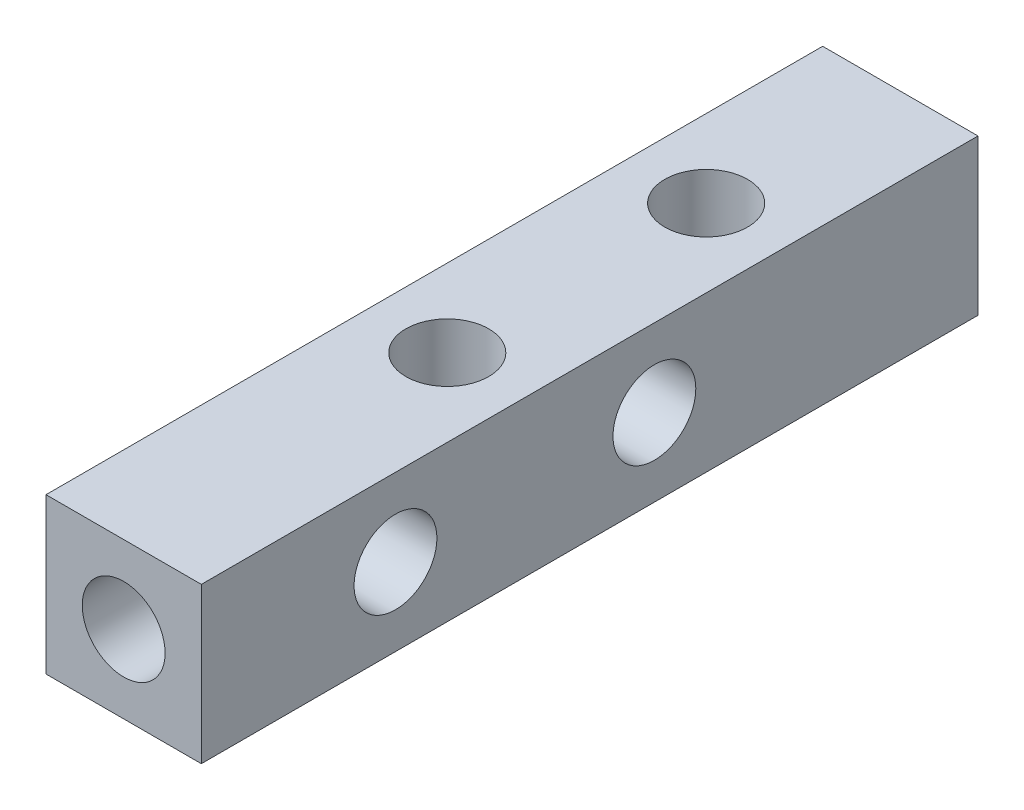
ISO-10303-21;
HEADER;
FILE_DESCRIPTION(('STEP AP214'),'2;1');
FILE_NAME('part.step','',(''),(''),'','','');
FILE_SCHEMA(('AUTOMOTIVE_DESIGN { 1 0 10303 214 1 1 1 1 }'));
ENDSEC;
DATA;
#1=APPLICATION_CONTEXT('core data for automotive mechanical design processes');
#2=APPLICATION_PROTOCOL_DEFINITION('international standard','automotive_design',2000,#1);
#3=PRODUCT_CONTEXT('',#1,'mechanical');
#4=PRODUCT('Part','Part','',(#3));
#5=PRODUCT_RELATED_PRODUCT_CATEGORY('part','',(#4));
#6=PRODUCT_DEFINITION_FORMATION('','',#4);
#7=PRODUCT_DEFINITION_CONTEXT('part definition',#1,'design');
#8=PRODUCT_DEFINITION('design','',#6,#7);
#9=PRODUCT_DEFINITION_SHAPE('','',#8);
#10=(LENGTH_UNIT() NAMED_UNIT(*) SI_UNIT(.MILLI.,.METRE.));
#11=(NAMED_UNIT(*) PLANE_ANGLE_UNIT() SI_UNIT($,.RADIAN.));
#12=(NAMED_UNIT(*) SI_UNIT($,.STERADIAN.) SOLID_ANGLE_UNIT());
#13=UNCERTAINTY_MEASURE_WITH_UNIT(LENGTH_MEASURE(1.E-05),#10,'distance_accuracy_value','');
#14=(GEOMETRIC_REPRESENTATION_CONTEXT(3) GLOBAL_UNCERTAINTY_ASSIGNED_CONTEXT((#13)) GLOBAL_UNIT_ASSIGNED_CONTEXT((#10,
#11,#12)) REPRESENTATION_CONTEXT('',''));
#15=CARTESIAN_POINT('',(0.,0.,0.));
#16=DIRECTION('',(0.,0.,1.));
#17=DIRECTION('',(1.,0.,0.));
#18=AXIS2_PLACEMENT_3D('',#15,#16,#17);
#19=CARTESIAN_POINT('',(0.,6.,30.));
#20=DIRECTION('',(1.,0.,0.));
#21=DIRECTION('',(0.,0.,-1.));
#22=AXIS2_PLACEMENT_3D('',#19,#20,#21);
#23=PLANE('',#22);
#24=CARTESIAN_POINT('',(0.,3.,22.5));
#25=DIRECTION('',(1.,0.,0.));
#26=DIRECTION('',(0.,0.,-1.));
#27=AXIS2_PLACEMENT_3D('',#24,#25,#26);
#28=CIRCLE('',#27,1.6);
#29=CARTESIAN_POINT('',(0.,3.,20.9));
#30=VERTEX_POINT('',#29);
#31=EDGE_CURVE('E122',#30,#30,#28,.T.);
#32=ORIENTED_EDGE('',*,*,#31,.T.);
#33=EDGE_LOOP('',(#32));
#34=FACE_BOUND('',#33,.T.);
#35=CARTESIAN_POINT('',(0.,2.99999999999999,12.5));
#36=DIRECTION('',(1.,0.,0.));
#37=DIRECTION('',(0.,0.,-1.));
#38=AXIS2_PLACEMENT_3D('',#35,#36,#37);
#39=CIRCLE('',#38,1.6);
#40=CARTESIAN_POINT('',(0.,2.99999999999999,10.9));
#41=VERTEX_POINT('',#40);
#42=EDGE_CURVE('E127',#41,#41,#39,.T.);
#43=ORIENTED_EDGE('',*,*,#42,.T.);
#44=EDGE_LOOP('',(#43));
#45=FACE_BOUND('',#44,.T.);
#46=DIRECTION('',(0.,-1.,0.));
#47=VECTOR('',#46,1.);
#48=CARTESIAN_POINT('',(0.,6.,0.));
#49=LINE('',#48,#47);
#50=CARTESIAN_POINT('',(0.,6.,0.));
#51=VERTEX_POINT('',#50);
#52=CARTESIAN_POINT('',(0.,0.,0.));
#53=VERTEX_POINT('',#52);
#54=EDGE_CURVE('E99',#51,#53,#49,.T.);
#55=ORIENTED_EDGE('',*,*,#54,.T.);
#56=DIRECTION('',(0.,0.,-1.));
#57=VECTOR('',#56,1.);
#58=CARTESIAN_POINT('',(0.,0.,30.));
#59=LINE('',#58,#57);
#60=CARTESIAN_POINT('',(0.,0.,30.));
#61=VERTEX_POINT('',#60);
#62=EDGE_CURVE('E11',#61,#53,#59,.T.);
#63=ORIENTED_EDGE('',*,*,#62,.F.);
#64=DIRECTION('',(0.,-1.,0.));
#65=VECTOR('',#64,1.);
#66=CARTESIAN_POINT('',(0.,6.,30.));
#67=LINE('',#66,#65);
#68=CARTESIAN_POINT('',(0.,6.,30.));
#69=VERTEX_POINT('',#68);
#70=EDGE_CURVE('E87',#69,#61,#67,.T.);
#71=ORIENTED_EDGE('',*,*,#70,.F.);
#72=DIRECTION('',(0.,0.,-1.));
#73=VECTOR('',#72,1.);
#74=CARTESIAN_POINT('',(0.,6.,30.));
#75=LINE('',#74,#73);
#76=EDGE_CURVE('E95',#69,#51,#75,.T.);
#77=ORIENTED_EDGE('',*,*,#76,.T.);
#78=EDGE_LOOP('',(#55,#63,#71,#77));
#79=FACE_BOUND('',#78,.T.);
#80=ADVANCED_FACE('F36',(#34,#45,#79),#23,.F.);
#81=CARTESIAN_POINT('',(0.,0.,30.));
#82=DIRECTION('',(0.,1.,0.));
#83=DIRECTION('',(0.,0.,1.));
#84=AXIS2_PLACEMENT_3D('',#81,#82,#83);
#85=PLANE('',#84);
#86=CARTESIAN_POINT('',(3.,0.,7.5));
#87=DIRECTION('',(0.,1.,0.));
#88=DIRECTION('',(0.,0.,1.));
#89=AXIS2_PLACEMENT_3D('',#86,#87,#88);
#90=CIRCLE('',#89,1.6);
#91=CARTESIAN_POINT('',(3.,0.,9.1));
#92=VERTEX_POINT('',#91);
#93=EDGE_CURVE('E134',#92,#92,#90,.T.);
#94=ORIENTED_EDGE('',*,*,#93,.T.);
#95=EDGE_LOOP('',(#94));
#96=FACE_BOUND('',#95,.T.);
#97=CARTESIAN_POINT('',(3.,0.,17.5));
#98=DIRECTION('',(0.,1.,0.));
#99=DIRECTION('',(0.,0.,1.));
#100=AXIS2_PLACEMENT_3D('',#97,#98,#99);
#101=CIRCLE('',#100,1.6);
#102=CARTESIAN_POINT('',(3.,0.,19.1));
#103=VERTEX_POINT('',#102);
#104=EDGE_CURVE('E139',#103,#103,#101,.T.);
#105=ORIENTED_EDGE('',*,*,#104,.T.);
#106=EDGE_LOOP('',(#105));
#107=FACE_BOUND('',#106,.T.);
#108=DIRECTION('',(1.,0.,0.));
#109=VECTOR('',#108,1.);
#110=CARTESIAN_POINT('',(0.,0.,0.));
#111=LINE('',#110,#109);
#112=CARTESIAN_POINT('',(6.,0.,0.));
#113=VERTEX_POINT('',#112);
#114=EDGE_CURVE('E91',#53,#113,#111,.T.);
#115=ORIENTED_EDGE('',*,*,#114,.T.);
#116=DIRECTION('',(0.,0.,-1.));
#117=VECTOR('',#116,1.);
#118=CARTESIAN_POINT('',(6.,0.,30.));
#119=LINE('',#118,#117);
#120=CARTESIAN_POINT('',(6.,0.,30.));
#121=VERTEX_POINT('',#120);
#122=EDGE_CURVE('E44',#121,#113,#119,.T.);
#123=ORIENTED_EDGE('',*,*,#122,.F.);
#124=DIRECTION('',(1.,0.,0.));
#125=VECTOR('',#124,1.);
#126=CARTESIAN_POINT('',(0.,0.,30.));
#127=LINE('',#126,#125);
#128=EDGE_CURVE('E82',#61,#121,#127,.T.);
#129=ORIENTED_EDGE('',*,*,#128,.F.);
#130=ORIENTED_EDGE('',*,*,#62,.T.);
#131=EDGE_LOOP('',(#115,#123,#129,#130));
#132=FACE_BOUND('',#131,.T.);
#133=ADVANCED_FACE('F90',(#96,#107,#132),#85,.F.);
#134=CARTESIAN_POINT('',(6.,0.,30.));
#135=DIRECTION('',(-1.,0.,0.));
#136=DIRECTION('',(0.,0.,1.));
#137=AXIS2_PLACEMENT_3D('',#134,#135,#136);
#138=PLANE('',#137);
#139=CARTESIAN_POINT('',(6.,3.,22.5));
#140=DIRECTION('',(1.,0.,0.));
#141=DIRECTION('',(0.,0.,-1.));
#142=AXIS2_PLACEMENT_3D('',#139,#140,#141);
#143=CIRCLE('',#142,1.6);
#144=CARTESIAN_POINT('',(6.,3.,20.9));
#145=VERTEX_POINT('',#144);
#146=EDGE_CURVE('E130',#145,#145,#143,.T.);
#147=ORIENTED_EDGE('',*,*,#146,.F.);
#148=EDGE_LOOP('',(#147));
#149=FACE_BOUND('',#148,.T.);
#150=CARTESIAN_POINT('',(6.,2.99999999999999,12.5));
#151=DIRECTION('',(1.,0.,0.));
#152=DIRECTION('',(0.,0.,-1.));
#153=AXIS2_PLACEMENT_3D('',#150,#151,#152);
#154=CIRCLE('',#153,1.6);
#155=CARTESIAN_POINT('',(6.,2.99999999999999,10.9));
#156=VERTEX_POINT('',#155);
#157=EDGE_CURVE('E131',#156,#156,#154,.T.);
#158=ORIENTED_EDGE('',*,*,#157,.F.);
#159=EDGE_LOOP('',(#158));
#160=FACE_BOUND('',#159,.T.);
#161=DIRECTION('',(0.,1.,0.));
#162=VECTOR('',#161,1.);
#163=CARTESIAN_POINT('',(6.,0.,0.));
#164=LINE('',#163,#162);
#165=CARTESIAN_POINT('',(6.,6.,0.));
#166=VERTEX_POINT('',#165);
#167=EDGE_CURVE('E69',#113,#166,#164,.T.);
#168=ORIENTED_EDGE('',*,*,#167,.T.);
#169=DIRECTION('',(0.,0.,-1.));
#170=VECTOR('',#169,1.);
#171=CARTESIAN_POINT('',(6.,6.,30.));
#172=LINE('',#171,#170);
#173=CARTESIAN_POINT('',(6.,6.,30.));
#174=VERTEX_POINT('',#173);
#175=EDGE_CURVE('E92',#174,#166,#172,.T.);
#176=ORIENTED_EDGE('',*,*,#175,.F.);
#177=DIRECTION('',(0.,1.,0.));
#178=VECTOR('',#177,1.);
#179=CARTESIAN_POINT('',(6.,0.,30.));
#180=LINE('',#179,#178);
#181=EDGE_CURVE('E85',#121,#174,#180,.T.);
#182=ORIENTED_EDGE('',*,*,#181,.F.);
#183=ORIENTED_EDGE('',*,*,#122,.T.);
#184=EDGE_LOOP('',(#168,#176,#182,#183));
#185=FACE_BOUND('',#184,.T.);
#186=ADVANCED_FACE('F93',(#149,#160,#185),#138,.F.);
#187=CARTESIAN_POINT('',(6.,6.,30.));
#188=DIRECTION('',(0.,-1.,0.));
#189=DIRECTION('',(0.,0.,-1.));
#190=AXIS2_PLACEMENT_3D('',#187,#188,#189);
#191=PLANE('',#190);
#192=CARTESIAN_POINT('',(3.,6.,7.5));
#193=DIRECTION('',(0.,1.,0.));
#194=DIRECTION('',(0.,0.,1.));
#195=AXIS2_PLACEMENT_3D('',#192,#193,#194);
#196=CIRCLE('',#195,1.6);
#197=CARTESIAN_POINT('',(3.,6.,9.1));
#198=VERTEX_POINT('',#197);
#199=EDGE_CURVE('E142',#198,#198,#196,.T.);
#200=ORIENTED_EDGE('',*,*,#199,.F.);
#201=EDGE_LOOP('',(#200));
#202=FACE_BOUND('',#201,.T.);
#203=CARTESIAN_POINT('',(3.,6.,17.5));
#204=DIRECTION('',(0.,1.,0.));
#205=DIRECTION('',(0.,0.,1.));
#206=AXIS2_PLACEMENT_3D('',#203,#204,#205);
#207=CIRCLE('',#206,1.6);
#208=CARTESIAN_POINT('',(3.,6.,19.1));
#209=VERTEX_POINT('',#208);
#210=EDGE_CURVE('E143',#209,#209,#207,.T.);
#211=ORIENTED_EDGE('',*,*,#210,.F.);
#212=EDGE_LOOP('',(#211));
#213=FACE_BOUND('',#212,.T.);
#214=DIRECTION('',(-1.,0.,0.));
#215=VECTOR('',#214,1.);
#216=CARTESIAN_POINT('',(6.,6.,0.));
#217=LINE('',#216,#215);
#218=EDGE_CURVE('E75',#166,#51,#217,.T.);
#219=ORIENTED_EDGE('',*,*,#218,.T.);
#220=ORIENTED_EDGE('',*,*,#76,.F.);
#221=DIRECTION('',(-1.,0.,0.));
#222=VECTOR('',#221,1.);
#223=CARTESIAN_POINT('',(6.,6.,30.));
#224=LINE('',#223,#222);
#225=EDGE_CURVE('E52',#174,#69,#224,.T.);
#226=ORIENTED_EDGE('',*,*,#225,.F.);
#227=ORIENTED_EDGE('',*,*,#175,.T.);
#228=EDGE_LOOP('',(#219,#220,#226,#227));
#229=FACE_BOUND('',#228,.T.);
#230=ADVANCED_FACE('F107',(#202,#213,#229),#191,.F.);
#231=CARTESIAN_POINT('',(0.,0.,30.));
#232=DIRECTION('',(0.,0.,1.));
#233=DIRECTION('',(1.,0.,0.));
#234=AXIS2_PLACEMENT_3D('',#231,#232,#233);
#235=PLANE('',#234);
#236=CARTESIAN_POINT('',(3.,3.,30.));
#237=DIRECTION('',(0.,0.,1.));
#238=DIRECTION('',(1.,0.,0.));
#239=AXIS2_PLACEMENT_3D('',#236,#237,#238);
#240=CIRCLE('',#239,1.6);
#241=CARTESIAN_POINT('',(4.6,3.,30.));
#242=VERTEX_POINT('',#241);
#243=EDGE_CURVE('E113',#242,#242,#240,.T.);
#244=ORIENTED_EDGE('',*,*,#243,.F.);
#245=EDGE_LOOP('',(#244));
#246=FACE_BOUND('',#245,.T.);
#247=ORIENTED_EDGE('',*,*,#70,.T.);
#248=ORIENTED_EDGE('',*,*,#128,.T.);
#249=ORIENTED_EDGE('',*,*,#181,.T.);
#250=ORIENTED_EDGE('',*,*,#225,.T.);
#251=EDGE_LOOP('',(#247,#248,#249,#250));
#252=FACE_BOUND('',#251,.T.);
#253=ADVANCED_FACE('F83',(#246,#252),#235,.T.);
#254=CARTESIAN_POINT('',(0.,0.,0.));
#255=DIRECTION('',(0.,0.,1.));
#256=DIRECTION('',(1.,0.,0.));
#257=AXIS2_PLACEMENT_3D('',#254,#255,#256);
#258=PLANE('',#257);
#259=CARTESIAN_POINT('',(3.,3.,0.));
#260=DIRECTION('',(0.,0.,1.));
#261=DIRECTION('',(1.,0.,0.));
#262=AXIS2_PLACEMENT_3D('',#259,#260,#261);
#263=CIRCLE('',#262,1.6);
#264=CARTESIAN_POINT('',(4.6,3.,0.));
#265=VERTEX_POINT('',#264);
#266=EDGE_CURVE('E119',#265,#265,#263,.T.);
#267=ORIENTED_EDGE('',*,*,#266,.T.);
#268=EDGE_LOOP('',(#267));
#269=FACE_BOUND('',#268,.T.);
#270=ORIENTED_EDGE('',*,*,#54,.F.);
#271=ORIENTED_EDGE('',*,*,#218,.F.);
#272=ORIENTED_EDGE('',*,*,#167,.F.);
#273=ORIENTED_EDGE('',*,*,#114,.F.);
#274=EDGE_LOOP('',(#270,#271,#272,#273));
#275=FACE_BOUND('',#274,.T.);
#276=ADVANCED_FACE('F110',(#269,#275),#258,.F.);
#277=CARTESIAN_POINT('',(3.,3.,25.));
#278=DIRECTION('',(0.,0.,1.));
#279=DIRECTION('',(1.,0.,0.));
#280=AXIS2_PLACEMENT_3D('',#277,#278,#279);
#281=CYLINDRICAL_SURFACE('',#280,1.6);
#282=CARTESIAN_POINT('',(3.,3.,25.));
#283=DIRECTION('',(0.,0.,1.));
#284=DIRECTION('',(1.,0.,0.));
#285=AXIS2_PLACEMENT_3D('',#282,#283,#284);
#286=CIRCLE('',#285,1.6);
#287=CARTESIAN_POINT('',(4.6,3.,25.));
#288=VERTEX_POINT('',#287);
#289=EDGE_CURVE('E102',#288,#288,#286,.T.);
#290=ORIENTED_EDGE('',*,*,#289,.F.);
#291=EDGE_LOOP('',(#290));
#292=FACE_BOUND('',#291,.T.);
#293=ORIENTED_EDGE('',*,*,#243,.T.);
#294=EDGE_LOOP('',(#293));
#295=FACE_BOUND('',#294,.T.);
#296=ADVANCED_FACE('F176',(#292,#295),#281,.F.);
#297=CARTESIAN_POINT('',(3.,3.,25.));
#298=DIRECTION('',(0.,0.,1.));
#299=DIRECTION('',(1.,0.,0.));
#300=AXIS2_PLACEMENT_3D('',#297,#298,#299);
#301=PLANE('',#300);
#302=ORIENTED_EDGE('',*,*,#289,.T.);
#303=EDGE_LOOP('',(#302));
#304=FACE_BOUND('',#303,.T.);
#305=ADVANCED_FACE('F183',(#304),#301,.T.);
#306=CARTESIAN_POINT('',(3.,3.,5.));
#307=DIRECTION('',(0.,0.,-1.));
#308=DIRECTION('',(-1.,0.,0.));
#309=AXIS2_PLACEMENT_3D('',#306,#307,#308);
#310=CYLINDRICAL_SURFACE('',#309,1.6);
#311=CARTESIAN_POINT('',(3.,3.,5.));
#312=DIRECTION('',(0.,0.,1.));
#313=DIRECTION('',(1.,0.,0.));
#314=AXIS2_PLACEMENT_3D('',#311,#312,#313);
#315=CIRCLE('',#314,1.6);
#316=CARTESIAN_POINT('',(4.6,3.,5.));
#317=VERTEX_POINT('',#316);
#318=EDGE_CURVE('E116',#317,#317,#315,.T.);
#319=ORIENTED_EDGE('',*,*,#318,.T.);
#320=EDGE_LOOP('',(#319));
#321=FACE_BOUND('',#320,.T.);
#322=ORIENTED_EDGE('',*,*,#266,.F.);
#323=EDGE_LOOP('',(#322));
#324=FACE_BOUND('',#323,.T.);
#325=ADVANCED_FACE('F187',(#321,#324),#310,.F.);
#326=CARTESIAN_POINT('',(3.,3.,5.));
#327=DIRECTION('',(0.,0.,1.));
#328=DIRECTION('',(1.,0.,0.));
#329=AXIS2_PLACEMENT_3D('',#326,#327,#328);
#330=PLANE('',#329);
#331=ORIENTED_EDGE('',*,*,#318,.F.);
#332=EDGE_LOOP('',(#331));
#333=FACE_BOUND('',#332,.T.);
#334=ADVANCED_FACE('F191',(#333),#330,.F.);
#335=CARTESIAN_POINT('',(-1.,2.99999999999999,12.5));
#336=DIRECTION('',(1.,0.,0.));
#337=DIRECTION('',(0.,0.,-1.));
#338=AXIS2_PLACEMENT_3D('',#335,#336,#337);
#339=CYLINDRICAL_SURFACE('',#338,1.6);
#340=ORIENTED_EDGE('',*,*,#157,.T.);
#341=EDGE_LOOP('',(#340));
#342=FACE_BOUND('',#341,.T.);
#343=ORIENTED_EDGE('',*,*,#42,.F.);
#344=EDGE_LOOP('',(#343));
#345=FACE_BOUND('',#344,.T.);
#346=ADVANCED_FACE('F195',(#342,#345),#339,.F.);
#347=CARTESIAN_POINT('',(-1.,3.,22.5));
#348=DIRECTION('',(1.,0.,0.));
#349=DIRECTION('',(0.,0.,-1.));
#350=AXIS2_PLACEMENT_3D('',#347,#348,#349);
#351=CYLINDRICAL_SURFACE('',#350,1.6);
#352=ORIENTED_EDGE('',*,*,#146,.T.);
#353=EDGE_LOOP('',(#352));
#354=FACE_BOUND('',#353,.T.);
#355=ORIENTED_EDGE('',*,*,#31,.F.);
#356=EDGE_LOOP('',(#355));
#357=FACE_BOUND('',#356,.T.);
#358=ADVANCED_FACE('F160',(#354,#357),#351,.F.);
#359=CARTESIAN_POINT('',(3.,-1.,17.5));
#360=DIRECTION('',(0.,1.,0.));
#361=DIRECTION('',(0.,0.,1.));
#362=AXIS2_PLACEMENT_3D('',#359,#360,#361);
#363=CYLINDRICAL_SURFACE('',#362,1.6);
#364=ORIENTED_EDGE('',*,*,#210,.T.);
#365=EDGE_LOOP('',(#364));
#366=FACE_BOUND('',#365,.T.);
#367=ORIENTED_EDGE('',*,*,#104,.F.);
#368=EDGE_LOOP('',(#367));
#369=FACE_BOUND('',#368,.T.);
#370=ADVANCED_FACE('F157',(#366,#369),#363,.F.);
#371=CARTESIAN_POINT('',(3.,-1.,7.5));
#372=DIRECTION('',(0.,1.,0.));
#373=DIRECTION('',(0.,0.,1.));
#374=AXIS2_PLACEMENT_3D('',#371,#372,#373);
#375=CYLINDRICAL_SURFACE('',#374,1.6);
#376=ORIENTED_EDGE('',*,*,#199,.T.);
#377=EDGE_LOOP('',(#376));
#378=FACE_BOUND('',#377,.T.);
#379=ORIENTED_EDGE('',*,*,#93,.F.);
#380=EDGE_LOOP('',(#379));
#381=FACE_BOUND('',#380,.T.);
#382=ADVANCED_FACE('F149',(#378,#381),#375,.F.);
#383=CLOSED_SHELL('',(#80,#133,#186,#230,#253,#276,#296,#305,#325,#334,#346,#358,#370,#382));
#384=MANIFOLD_SOLID_BREP('B2',#383);
#385=ADVANCED_BREP_SHAPE_REPRESENTATION('',(#18,#384),#14);
#386=SHAPE_DEFINITION_REPRESENTATION(#9,#385);
ENDSEC;
END-ISO-10303-21;
